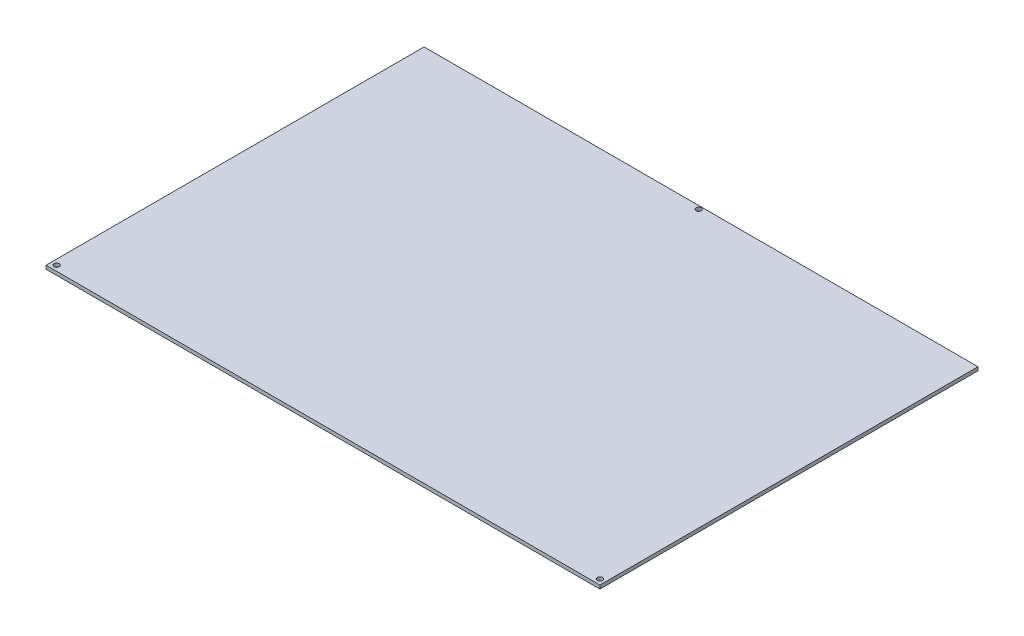
ISO-10303-21;
HEADER;
FILE_DESCRIPTION(('STEP AP214'),'2;1');
FILE_NAME('part.step','',(''),(''),'','','');
FILE_SCHEMA(('AUTOMOTIVE_DESIGN { 1 0 10303 214 1 1 1 1 }'));
ENDSEC;
DATA;
#1=APPLICATION_CONTEXT('core data for automotive mechanical design processes');
#2=APPLICATION_PROTOCOL_DEFINITION('international standard','automotive_design',2000,#1);
#3=PRODUCT_CONTEXT('',#1,'mechanical');
#4=PRODUCT('Part','Part','',(#3));
#5=PRODUCT_RELATED_PRODUCT_CATEGORY('part','',(#4));
#6=PRODUCT_DEFINITION_FORMATION('','',#4);
#7=PRODUCT_DEFINITION_CONTEXT('part definition',#1,'design');
#8=PRODUCT_DEFINITION('design','',#6,#7);
#9=PRODUCT_DEFINITION_SHAPE('','',#8);
#10=(LENGTH_UNIT() NAMED_UNIT(*) SI_UNIT(.MILLI.,.METRE.));
#11=(NAMED_UNIT(*) PLANE_ANGLE_UNIT() SI_UNIT($,.RADIAN.));
#12=(NAMED_UNIT(*) SI_UNIT($,.STERADIAN.) SOLID_ANGLE_UNIT());
#13=UNCERTAINTY_MEASURE_WITH_UNIT(LENGTH_MEASURE(1.E-05),#10,'distance_accuracy_value','');
#14=(GEOMETRIC_REPRESENTATION_CONTEXT(3) GLOBAL_UNCERTAINTY_ASSIGNED_CONTEXT((#13)) GLOBAL_UNIT_ASSIGNED_CONTEXT((#10,
#11,#12)) REPRESENTATION_CONTEXT('',''));
#15=CARTESIAN_POINT('',(0.,0.,0.));
#16=DIRECTION('',(0.,0.,1.));
#17=DIRECTION('',(1.,0.,0.));
#18=AXIS2_PLACEMENT_3D('',#15,#16,#17);
#19=CARTESIAN_POINT('',(0.,2.,0.));
#20=DIRECTION('',(1.,0.,0.));
#21=DIRECTION('',(0.,0.,-1.));
#22=AXIS2_PLACEMENT_3D('',#19,#20,#21);
#23=PLANE('',#22);
#24=DIRECTION('',(0.,0.,1.));
#25=VECTOR('',#24,1.);
#26=CARTESIAN_POINT('',(0.,0.,0.));
#27=LINE('',#26,#25);
#28=CARTESIAN_POINT('',(0.,0.,-215.));
#29=VERTEX_POINT('',#28);
#30=CARTESIAN_POINT('',(0.,0.,0.));
#31=VERTEX_POINT('',#30);
#32=EDGE_CURVE('E98',#29,#31,#27,.T.);
#33=ORIENTED_EDGE('',*,*,#32,.T.);
#34=DIRECTION('',(0.,-1.,0.));
#35=VECTOR('',#34,1.);
#36=CARTESIAN_POINT('',(0.,2.,0.));
#37=LINE('',#36,#35);
#38=CARTESIAN_POINT('',(0.,2.,0.));
#39=VERTEX_POINT('',#38);
#40=EDGE_CURVE('E11',#39,#31,#37,.T.);
#41=ORIENTED_EDGE('',*,*,#40,.F.);
#42=DIRECTION('',(0.,0.,1.));
#43=VECTOR('',#42,1.);
#44=CARTESIAN_POINT('',(0.,2.,0.));
#45=LINE('',#44,#43);
#46=CARTESIAN_POINT('',(0.,2.,-215.));
#47=VERTEX_POINT('',#46);
#48=EDGE_CURVE('E85',#47,#39,#45,.T.);
#49=ORIENTED_EDGE('',*,*,#48,.F.);
#50=DIRECTION('',(0.,-1.,0.));
#51=VECTOR('',#50,1.);
#52=CARTESIAN_POINT('',(0.,2.,-215.));
#53=LINE('',#52,#51);
#54=EDGE_CURVE('E94',#47,#29,#53,.T.);
#55=ORIENTED_EDGE('',*,*,#54,.T.);
#56=EDGE_LOOP('',(#33,#41,#49,#55));
#57=FACE_BOUND('',#56,.T.);
#58=ADVANCED_FACE('F32',(#57),#23,.F.);
#59=CARTESIAN_POINT('',(0.,2.,0.));
#60=DIRECTION('',(0.,0.,-1.));
#61=DIRECTION('',(-1.,0.,0.));
#62=AXIS2_PLACEMENT_3D('',#59,#60,#61);
#63=PLANE('',#62);
#64=DIRECTION('',(1.,0.,0.));
#65=VECTOR('',#64,1.);
#66=CARTESIAN_POINT('',(0.,0.,0.));
#67=LINE('',#66,#65);
#68=CARTESIAN_POINT('',(315.,0.,0.));
#69=VERTEX_POINT('',#68);
#70=EDGE_CURVE('E89',#31,#69,#67,.T.);
#71=ORIENTED_EDGE('',*,*,#70,.T.);
#72=DIRECTION('',(0.,-1.,0.));
#73=VECTOR('',#72,1.);
#74=CARTESIAN_POINT('',(315.,2.,0.));
#75=LINE('',#74,#73);
#76=CARTESIAN_POINT('',(315.,2.,0.));
#77=VERTEX_POINT('',#76);
#78=EDGE_CURVE('E41',#77,#69,#75,.T.);
#79=ORIENTED_EDGE('',*,*,#78,.F.);
#80=DIRECTION('',(1.,0.,0.));
#81=VECTOR('',#80,1.);
#82=CARTESIAN_POINT('',(0.,2.,0.));
#83=LINE('',#82,#81);
#84=EDGE_CURVE('E80',#39,#77,#83,.T.);
#85=ORIENTED_EDGE('',*,*,#84,.F.);
#86=ORIENTED_EDGE('',*,*,#40,.T.);
#87=EDGE_LOOP('',(#71,#79,#85,#86));
#88=FACE_BOUND('',#87,.T.);
#89=ADVANCED_FACE('F88',(#88),#63,.F.);
#90=CARTESIAN_POINT('',(315.,2.,0.));
#91=DIRECTION('',(-1.,0.,0.));
#92=DIRECTION('',(0.,0.,1.));
#93=AXIS2_PLACEMENT_3D('',#90,#91,#92);
#94=PLANE('',#93);
#95=DIRECTION('',(0.,0.,-1.));
#96=VECTOR('',#95,1.);
#97=CARTESIAN_POINT('',(315.,0.,0.));
#98=LINE('',#97,#96);
#99=CARTESIAN_POINT('',(315.,0.,-215.));
#100=VERTEX_POINT('',#99);
#101=EDGE_CURVE('E67',#69,#100,#98,.T.);
#102=ORIENTED_EDGE('',*,*,#101,.T.);
#103=DIRECTION('',(0.,-1.,0.));
#104=VECTOR('',#103,1.);
#105=CARTESIAN_POINT('',(315.,2.,-215.));
#106=LINE('',#105,#104);
#107=CARTESIAN_POINT('',(315.,2.,-215.));
#108=VERTEX_POINT('',#107);
#109=EDGE_CURVE('E90',#108,#100,#106,.T.);
#110=ORIENTED_EDGE('',*,*,#109,.F.);
#111=DIRECTION('',(0.,0.,-1.));
#112=VECTOR('',#111,1.);
#113=CARTESIAN_POINT('',(315.,2.,0.));
#114=LINE('',#113,#112);
#115=EDGE_CURVE('E83',#77,#108,#114,.T.);
#116=ORIENTED_EDGE('',*,*,#115,.F.);
#117=ORIENTED_EDGE('',*,*,#78,.T.);
#118=EDGE_LOOP('',(#102,#110,#116,#117));
#119=FACE_BOUND('',#118,.T.);
#120=ADVANCED_FACE('F92',(#119),#94,.F.);
#121=CARTESIAN_POINT('',(0.,2.,-215.));
#122=DIRECTION('',(0.,0.,1.));
#123=DIRECTION('',(1.,0.,0.));
#124=AXIS2_PLACEMENT_3D('',#121,#122,#123);
#125=PLANE('',#124);
#126=DIRECTION('',(-1.,0.,0.));
#127=VECTOR('',#126,1.);
#128=CARTESIAN_POINT('',(0.,0.,-215.));
#129=LINE('',#128,#127);
#130=EDGE_CURVE('E73',#100,#29,#129,.T.);
#131=ORIENTED_EDGE('',*,*,#130,.T.);
#132=ORIENTED_EDGE('',*,*,#54,.F.);
#133=DIRECTION('',(-1.,0.,0.));
#134=VECTOR('',#133,1.);
#135=CARTESIAN_POINT('',(0.,2.,-215.));
#136=LINE('',#135,#134);
#137=EDGE_CURVE('E50',#108,#47,#136,.T.);
#138=ORIENTED_EDGE('',*,*,#137,.F.);
#139=ORIENTED_EDGE('',*,*,#109,.T.);
#140=EDGE_LOOP('',(#131,#132,#138,#139));
#141=FACE_BOUND('',#140,.T.);
#142=ADVANCED_FACE('F131',(#141),#125,.F.);
#143=CARTESIAN_POINT('',(0.,2.,0.));
#144=DIRECTION('',(0.,-1.,0.));
#145=DIRECTION('',(0.,0.,-1.));
#146=AXIS2_PLACEMENT_3D('',#143,#144,#145);
#147=PLANE('',#146);
#148=CARTESIAN_POINT('',(158.,2.,-213.117089456496));
#149=DIRECTION('',(0.,1.,0.));
#150=DIRECTION('',(0.,0.,1.));
#151=AXIS2_PLACEMENT_3D('',#148,#149,#150);
#152=CIRCLE('',#151,1.5);
#153=CARTESIAN_POINT('',(158.,2.,-211.617089456496));
#154=VERTEX_POINT('',#153);
#155=EDGE_CURVE('E121',#154,#154,#152,.T.);
#156=ORIENTED_EDGE('',*,*,#155,.F.);
#157=EDGE_LOOP('',(#156));
#158=FACE_BOUND('',#157,.T.);
#159=CARTESIAN_POINT('',(312.,2.,-3.));
#160=DIRECTION('',(0.,1.,0.));
#161=DIRECTION('',(0.,0.,1.));
#162=AXIS2_PLACEMENT_3D('',#159,#160,#161);
#163=CIRCLE('',#162,1.50000000000002);
#164=CARTESIAN_POINT('',(312.,2.,-1.49999999999998));
#165=VERTEX_POINT('',#164);
#166=EDGE_CURVE('E111',#165,#165,#163,.T.);
#167=ORIENTED_EDGE('',*,*,#166,.F.);
#168=EDGE_LOOP('',(#167));
#169=FACE_BOUND('',#168,.T.);
#170=CARTESIAN_POINT('',(3.,2.,-3.));
#171=DIRECTION('',(0.,1.,0.));
#172=DIRECTION('',(0.,0.,1.));
#173=AXIS2_PLACEMENT_3D('',#170,#171,#172);
#174=CIRCLE('',#173,1.5);
#175=CARTESIAN_POINT('',(3.,2.,-1.5));
#176=VERTEX_POINT('',#175);
#177=EDGE_CURVE('E108',#176,#176,#174,.T.);
#178=ORIENTED_EDGE('',*,*,#177,.F.);
#179=EDGE_LOOP('',(#178));
#180=FACE_BOUND('',#179,.T.);
#181=ORIENTED_EDGE('',*,*,#48,.T.);
#182=ORIENTED_EDGE('',*,*,#84,.T.);
#183=ORIENTED_EDGE('',*,*,#115,.T.);
#184=ORIENTED_EDGE('',*,*,#137,.T.);
#185=EDGE_LOOP('',(#181,#182,#183,#184));
#186=FACE_BOUND('',#185,.T.);
#187=ADVANCED_FACE('F81',(#158,#169,#180,#186),#147,.F.);
#188=CARTESIAN_POINT('',(0.,0.,0.));
#189=DIRECTION('',(0.,-1.,0.));
#190=DIRECTION('',(0.,0.,-1.));
#191=AXIS2_PLACEMENT_3D('',#188,#189,#190);
#192=PLANE('',#191);
#193=CARTESIAN_POINT('',(158.,0.,-213.117089456496));
#194=DIRECTION('',(0.,-1.,0.));
#195=DIRECTION('',(0.,0.,-1.));
#196=AXIS2_PLACEMENT_3D('',#193,#194,#195);
#197=CIRCLE('',#196,1.5);
#198=CARTESIAN_POINT('',(158.,0.,-214.617089456496));
#199=VERTEX_POINT('',#198);
#200=EDGE_CURVE('E35',#199,#199,#197,.T.);
#201=ORIENTED_EDGE('',*,*,#200,.F.);
#202=EDGE_LOOP('',(#201));
#203=FACE_BOUND('',#202,.T.);
#204=CARTESIAN_POINT('',(312.,0.,-3.));
#205=DIRECTION('',(0.,-1.,0.));
#206=DIRECTION('',(0.,0.,-1.));
#207=AXIS2_PLACEMENT_3D('',#204,#205,#206);
#208=CIRCLE('',#207,1.50000000000002);
#209=CARTESIAN_POINT('',(312.,0.,-4.50000000000002));
#210=VERTEX_POINT('',#209);
#211=EDGE_CURVE('E109',#210,#210,#208,.T.);
#212=ORIENTED_EDGE('',*,*,#211,.F.);
#213=EDGE_LOOP('',(#212));
#214=FACE_BOUND('',#213,.T.);
#215=CARTESIAN_POINT('',(3.,0.,-3.));
#216=DIRECTION('',(0.,-1.,0.));
#217=DIRECTION('',(0.,0.,-1.));
#218=AXIS2_PLACEMENT_3D('',#215,#216,#217);
#219=CIRCLE('',#218,1.5);
#220=CARTESIAN_POINT('',(3.,0.,-4.5));
#221=VERTEX_POINT('',#220);
#222=EDGE_CURVE('E101',#221,#221,#219,.T.);
#223=ORIENTED_EDGE('',*,*,#222,.F.);
#224=EDGE_LOOP('',(#223));
#225=FACE_BOUND('',#224,.T.);
#226=ORIENTED_EDGE('',*,*,#32,.F.);
#227=ORIENTED_EDGE('',*,*,#130,.F.);
#228=ORIENTED_EDGE('',*,*,#101,.F.);
#229=ORIENTED_EDGE('',*,*,#70,.F.);
#230=EDGE_LOOP('',(#226,#227,#228,#229));
#231=FACE_BOUND('',#230,.T.);
#232=ADVANCED_FACE('F130',(#203,#214,#225,#231),#192,.T.);
#233=CARTESIAN_POINT('',(3.,-45.,-3.));
#234=DIRECTION('',(0.,1.,0.));
#235=DIRECTION('',(0.,0.,1.));
#236=AXIS2_PLACEMENT_3D('',#233,#234,#235);
#237=CYLINDRICAL_SURFACE('',#236,1.5);
#238=ORIENTED_EDGE('',*,*,#222,.T.);
#239=EDGE_LOOP('',(#238));
#240=FACE_BOUND('',#239,.T.);
#241=ORIENTED_EDGE('',*,*,#177,.T.);
#242=EDGE_LOOP('',(#241));
#243=FACE_BOUND('',#242,.T.);
#244=ADVANCED_FACE('F136',(#240,#243),#237,.F.);
#245=CARTESIAN_POINT('',(312.,-45.,-3.));
#246=DIRECTION('',(0.,1.,0.));
#247=DIRECTION('',(0.,0.,1.));
#248=AXIS2_PLACEMENT_3D('',#245,#246,#247);
#249=CYLINDRICAL_SURFACE('',#248,1.50000000000002);
#250=ORIENTED_EDGE('',*,*,#211,.T.);
#251=EDGE_LOOP('',(#250));
#252=FACE_BOUND('',#251,.T.);
#253=ORIENTED_EDGE('',*,*,#166,.T.);
#254=EDGE_LOOP('',(#253));
#255=FACE_BOUND('',#254,.T.);
#256=ADVANCED_FACE('F138',(#252,#255),#249,.F.);
#257=CARTESIAN_POINT('',(158.,-45.,-213.117089456496));
#258=DIRECTION('',(0.,1.,0.));
#259=DIRECTION('',(0.,0.,1.));
#260=AXIS2_PLACEMENT_3D('',#257,#258,#259);
#261=CYLINDRICAL_SURFACE('',#260,1.5);
#262=ORIENTED_EDGE('',*,*,#200,.T.);
#263=EDGE_LOOP('',(#262));
#264=FACE_BOUND('',#263,.T.);
#265=ORIENTED_EDGE('',*,*,#155,.T.);
#266=EDGE_LOOP('',(#265));
#267=FACE_BOUND('',#266,.T.);
#268=ADVANCED_FACE('F126',(#264,#267),#261,.F.);
#269=CLOSED_SHELL('',(#58,#89,#120,#142,#187,#232,#244,#256,#268));
#270=MANIFOLD_SOLID_BREP('B2',#269);
#271=ADVANCED_BREP_SHAPE_REPRESENTATION('',(#18,#270),#14);
#272=SHAPE_DEFINITION_REPRESENTATION(#9,#271);
ENDSEC;
END-ISO-10303-21;
